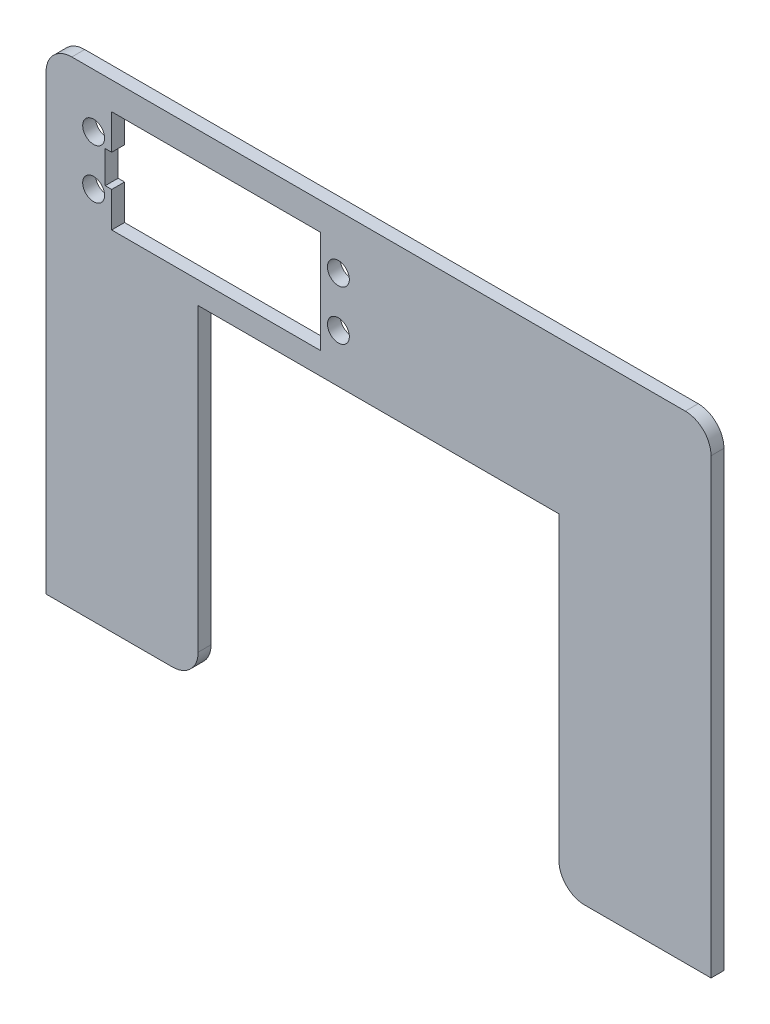
ISO-10303-21;
HEADER;
FILE_DESCRIPTION(('STEP AP214'),'2;1');
FILE_NAME('part.step','',(''),(''),'','','');
FILE_SCHEMA(('AUTOMOTIVE_DESIGN { 1 0 10303 214 1 1 1 1 }'));
ENDSEC;
DATA;
#1=APPLICATION_CONTEXT('core data for automotive mechanical design processes');
#2=APPLICATION_PROTOCOL_DEFINITION('international standard','automotive_design',2000,#1);
#3=PRODUCT_CONTEXT('',#1,'mechanical');
#4=PRODUCT('Part','Part','',(#3));
#5=PRODUCT_RELATED_PRODUCT_CATEGORY('part','',(#4));
#6=PRODUCT_DEFINITION_FORMATION('','',#4);
#7=PRODUCT_DEFINITION_CONTEXT('part definition',#1,'design');
#8=PRODUCT_DEFINITION('design','',#6,#7);
#9=PRODUCT_DEFINITION_SHAPE('','',#8);
#10=(LENGTH_UNIT() NAMED_UNIT(*) SI_UNIT(.MILLI.,.METRE.));
#11=(NAMED_UNIT(*) PLANE_ANGLE_UNIT() SI_UNIT($,.RADIAN.));
#12=(NAMED_UNIT(*) SI_UNIT($,.STERADIAN.) SOLID_ANGLE_UNIT());
#13=UNCERTAINTY_MEASURE_WITH_UNIT(LENGTH_MEASURE(1.E-05),#10,'distance_accuracy_value','');
#14=(GEOMETRIC_REPRESENTATION_CONTEXT(3) GLOBAL_UNCERTAINTY_ASSIGNED_CONTEXT((#13)) GLOBAL_UNIT_ASSIGNED_CONTEXT((#10,
#11,#12)) REPRESENTATION_CONTEXT('',''));
#15=CARTESIAN_POINT('',(0.,0.,0.));
#16=DIRECTION('',(0.,0.,1.));
#17=DIRECTION('',(1.,0.,0.));
#18=AXIS2_PLACEMENT_3D('',#15,#16,#17);
#19=CARTESIAN_POINT('',(-52.625,41.7055,0.));
#20=DIRECTION('',(-1.,0.,0.));
#21=DIRECTION('',(0.,0.,1.));
#22=AXIS2_PLACEMENT_3D('',#19,#20,#21);
#23=PLANE('',#22);
#24=DIRECTION('',(0.,-1.,0.));
#25=VECTOR('',#24,1.);
#26=CARTESIAN_POINT('',(-52.625,41.7055,2.54));
#27=LINE('',#26,#25);
#28=CARTESIAN_POINT('',(-52.625,41.7055,2.54));
#29=VERTEX_POINT('',#28);
#30=CARTESIAN_POINT('',(-52.625,34.784,2.54));
#31=VERTEX_POINT('',#30);
#32=EDGE_CURVE('E238',#29,#31,#27,.T.);
#33=ORIENTED_EDGE('',*,*,#32,.T.);
#34=DIRECTION('',(0.,0.,-1.));
#35=VECTOR('',#34,1.);
#36=CARTESIAN_POINT('',(-52.625,34.784,0.));
#37=LINE('',#36,#35);
#38=CARTESIAN_POINT('',(-52.625,34.784,0.));
#39=VERTEX_POINT('',#38);
#40=EDGE_CURVE('E11',#31,#39,#37,.T.);
#41=ORIENTED_EDGE('',*,*,#40,.T.);
#42=DIRECTION('',(0.,-1.,0.));
#43=VECTOR('',#42,1.);
#44=CARTESIAN_POINT('',(-52.625,41.7055,0.));
#45=LINE('',#44,#43);
#46=CARTESIAN_POINT('',(-52.625,41.7055,0.));
#47=VERTEX_POINT('',#46);
#48=EDGE_CURVE('E225',#47,#39,#45,.T.);
#49=ORIENTED_EDGE('',*,*,#48,.F.);
#50=DIRECTION('',(0.,0.,1.));
#51=VECTOR('',#50,1.);
#52=CARTESIAN_POINT('',(-52.625,41.7055,0.));
#53=LINE('',#52,#51);
#54=EDGE_CURVE('E250',#47,#29,#53,.T.);
#55=ORIENTED_EDGE('',*,*,#54,.T.);
#56=EDGE_LOOP('',(#33,#41,#49,#55));
#57=FACE_BOUND('',#56,.T.);
#58=ADVANCED_FACE('F33',(#57),#23,.F.);
#59=CARTESIAN_POINT('',(-65.56,-47.131,2.54));
#60=DIRECTION('',(1.,0.,0.));
#61=DIRECTION('',(0.,0.,-1.));
#62=AXIS2_PLACEMENT_3D('',#59,#60,#61);
#63=PLANE('',#62);
#64=DIRECTION('',(0.,-1.,0.));
#65=VECTOR('',#64,1.);
#66=CARTESIAN_POINT('',(-65.56,-47.131,2.54));
#67=LINE('',#66,#65);
#68=CARTESIAN_POINT('',(-65.56,42.051,2.54));
#69=VERTEX_POINT('',#68);
#70=CARTESIAN_POINT('',(-65.56,-47.131,2.54));
#71=VERTEX_POINT('',#70);
#72=EDGE_CURVE('E259',#69,#71,#67,.T.);
#73=ORIENTED_EDGE('',*,*,#72,.F.);
#74=DIRECTION('',(0.,0.,-1.));
#75=VECTOR('',#74,1.);
#76=CARTESIAN_POINT('',(-65.56,42.051,2.54));
#77=LINE('',#76,#75);
#78=CARTESIAN_POINT('',(-65.56,42.051,0.));
#79=VERTEX_POINT('',#78);
#80=EDGE_CURVE('E331',#69,#79,#77,.T.);
#81=ORIENTED_EDGE('',*,*,#80,.T.);
#82=DIRECTION('',(0.,-1.,0.));
#83=VECTOR('',#82,1.);
#84=CARTESIAN_POINT('',(-65.56,-47.131,0.));
#85=LINE('',#84,#83);
#86=CARTESIAN_POINT('',(-65.56,-47.131,0.));
#87=VERTEX_POINT('',#86);
#88=EDGE_CURVE('E252',#79,#87,#85,.T.);
#89=ORIENTED_EDGE('',*,*,#88,.T.);
#90=DIRECTION('',(0.,0.,-1.));
#91=VECTOR('',#90,1.);
#92=CARTESIAN_POINT('',(-65.56,-47.131,2.54));
#93=LINE('',#92,#91);
#94=EDGE_CURVE('E306',#71,#87,#93,.T.);
#95=ORIENTED_EDGE('',*,*,#94,.F.);
#96=EDGE_LOOP('',(#73,#81,#89,#95));
#97=FACE_BOUND('',#96,.T.);
#98=ADVANCED_FACE('F378',(#97),#63,.F.);
#99=CARTESIAN_POINT('',(-35.56,-47.131,2.54));
#100=DIRECTION('',(0.,1.,0.));
#101=DIRECTION('',(-1.,0.,0.));
#102=AXIS2_PLACEMENT_3D('',#99,#100,#101);
#103=PLANE('',#102);
#104=DIRECTION('',(1.,0.,0.));
#105=VECTOR('',#104,1.);
#106=CARTESIAN_POINT('',(-35.56,-47.131,0.));
#107=LINE('',#106,#105);
#108=CARTESIAN_POINT('',(-40.64,-47.131,0.));
#109=VERTEX_POINT('',#108);
#110=EDGE_CURVE('E281',#87,#109,#107,.T.);
#111=ORIENTED_EDGE('',*,*,#110,.T.);
#112=DIRECTION('',(0.,0.,-1.));
#113=VECTOR('',#112,1.);
#114=CARTESIAN_POINT('',(-40.64,-47.131,2.54));
#115=LINE('',#114,#113);
#116=CARTESIAN_POINT('',(-40.64,-47.131,2.54));
#117=VERTEX_POINT('',#116);
#118=EDGE_CURVE('E342',#109,#117,#115,.F.);
#119=ORIENTED_EDGE('',*,*,#118,.T.);
#120=DIRECTION('',(1.,0.,0.));
#121=VECTOR('',#120,1.);
#122=CARTESIAN_POINT('',(-35.56,-47.131,2.54));
#123=LINE('',#122,#121);
#124=EDGE_CURVE('E261',#71,#117,#123,.T.);
#125=ORIENTED_EDGE('',*,*,#124,.F.);
#126=ORIENTED_EDGE('',*,*,#94,.T.);
#127=EDGE_LOOP('',(#111,#119,#125,#126));
#128=FACE_BOUND('',#127,.T.);
#129=ADVANCED_FACE('F383',(#128),#103,.F.);
#130=CARTESIAN_POINT('',(-35.56,17.131,2.54));
#131=DIRECTION('',(-1.,0.,0.));
#132=DIRECTION('',(0.,0.,1.));
#133=AXIS2_PLACEMENT_3D('',#130,#131,#132);
#134=PLANE('',#133);
#135=DIRECTION('',(0.,1.,0.));
#136=VECTOR('',#135,1.);
#137=CARTESIAN_POINT('',(-35.56,17.131,2.54));
#138=LINE('',#137,#136);
#139=CARTESIAN_POINT('',(-35.56,-42.051,2.54));
#140=VERTEX_POINT('',#139);
#141=CARTESIAN_POINT('',(-35.56,17.131,2.54));
#142=VERTEX_POINT('',#141);
#143=EDGE_CURVE('E265',#140,#142,#138,.T.);
#144=ORIENTED_EDGE('',*,*,#143,.F.);
#145=DIRECTION('',(0.,0.,-1.));
#146=VECTOR('',#145,1.);
#147=CARTESIAN_POINT('',(-35.56,-42.051,2.54));
#148=LINE('',#147,#146);
#149=CARTESIAN_POINT('',(-35.56,-42.051,0.));
#150=VERTEX_POINT('',#149);
#151=EDGE_CURVE('E339',#140,#150,#148,.T.);
#152=ORIENTED_EDGE('',*,*,#151,.T.);
#153=DIRECTION('',(0.,1.,0.));
#154=VECTOR('',#153,1.);
#155=CARTESIAN_POINT('',(-35.56,17.131,0.));
#156=LINE('',#155,#154);
#157=CARTESIAN_POINT('',(-35.56,17.131,0.));
#158=VERTEX_POINT('',#157);
#159=EDGE_CURVE('E284',#150,#158,#156,.T.);
#160=ORIENTED_EDGE('',*,*,#159,.T.);
#161=DIRECTION('',(0.,0.,-1.));
#162=VECTOR('',#161,1.);
#163=CARTESIAN_POINT('',(-35.56,17.131,2.54));
#164=LINE('',#163,#162);
#165=EDGE_CURVE('E303',#142,#158,#164,.T.);
#166=ORIENTED_EDGE('',*,*,#165,.F.);
#167=EDGE_LOOP('',(#144,#152,#160,#166));
#168=FACE_BOUND('',#167,.T.);
#169=ADVANCED_FACE('F420',(#168),#134,.F.);
#170=CARTESIAN_POINT('',(35.56,17.131,2.54));
#171=DIRECTION('',(0.,1.,0.));
#172=DIRECTION('',(0.,0.,1.));
#173=AXIS2_PLACEMENT_3D('',#170,#171,#172);
#174=PLANE('',#173);
#175=DIRECTION('',(1.,0.,0.));
#176=VECTOR('',#175,1.);
#177=CARTESIAN_POINT('',(35.56,17.131,0.));
#178=LINE('',#177,#176);
#179=CARTESIAN_POINT('',(35.56,17.131,0.));
#180=VERTEX_POINT('',#179);
#181=EDGE_CURVE('E286',#158,#180,#178,.T.);
#182=ORIENTED_EDGE('',*,*,#181,.T.);
#183=DIRECTION('',(0.,0.,-1.));
#184=VECTOR('',#183,1.);
#185=CARTESIAN_POINT('',(35.56,17.131,2.54));
#186=LINE('',#185,#184);
#187=CARTESIAN_POINT('',(35.56,17.131,2.54));
#188=VERTEX_POINT('',#187);
#189=EDGE_CURVE('E300',#188,#180,#186,.T.);
#190=ORIENTED_EDGE('',*,*,#189,.F.);
#191=DIRECTION('',(1.,0.,0.));
#192=VECTOR('',#191,1.);
#193=CARTESIAN_POINT('',(35.56,17.131,2.54));
#194=LINE('',#193,#192);
#195=EDGE_CURVE('E267',#142,#188,#194,.T.);
#196=ORIENTED_EDGE('',*,*,#195,.F.);
#197=ORIENTED_EDGE('',*,*,#165,.T.);
#198=EDGE_LOOP('',(#182,#190,#196,#197));
#199=FACE_BOUND('',#198,.T.);
#200=ADVANCED_FACE('F416',(#199),#174,.F.);
#201=CARTESIAN_POINT('',(35.56,-47.131,2.54));
#202=DIRECTION('',(1.,0.,0.));
#203=DIRECTION('',(0.,1.,0.));
#204=AXIS2_PLACEMENT_3D('',#201,#202,#203);
#205=PLANE('',#204);
#206=DIRECTION('',(0.,-1.,0.));
#207=VECTOR('',#206,1.);
#208=CARTESIAN_POINT('',(35.56,-47.131,0.));
#209=LINE('',#208,#207);
#210=CARTESIAN_POINT('',(35.56,-42.051,0.));
#211=VERTEX_POINT('',#210);
#212=EDGE_CURVE('E288',#180,#211,#209,.T.);
#213=ORIENTED_EDGE('',*,*,#212,.T.);
#214=DIRECTION('',(0.,0.,-1.));
#215=VECTOR('',#214,1.);
#216=CARTESIAN_POINT('',(35.56,-42.051,2.54));
#217=LINE('',#216,#215);
#218=CARTESIAN_POINT('',(35.56,-42.051,2.54));
#219=VERTEX_POINT('',#218);
#220=EDGE_CURVE('E337',#211,#219,#217,.F.);
#221=ORIENTED_EDGE('',*,*,#220,.T.);
#222=DIRECTION('',(0.,-1.,0.));
#223=VECTOR('',#222,1.);
#224=CARTESIAN_POINT('',(35.56,-47.131,2.54));
#225=LINE('',#224,#223);
#226=EDGE_CURVE('E269',#188,#219,#225,.T.);
#227=ORIENTED_EDGE('',*,*,#226,.F.);
#228=ORIENTED_EDGE('',*,*,#189,.T.);
#229=EDGE_LOOP('',(#213,#221,#227,#228));
#230=FACE_BOUND('',#229,.T.);
#231=ADVANCED_FACE('F412',(#230),#205,.F.);
#232=CARTESIAN_POINT('',(65.56,-47.131,2.54));
#233=DIRECTION('',(0.,1.,0.));
#234=DIRECTION('',(-1.,0.,0.));
#235=AXIS2_PLACEMENT_3D('',#232,#233,#234);
#236=PLANE('',#235);
#237=DIRECTION('',(1.,0.,0.));
#238=VECTOR('',#237,1.);
#239=CARTESIAN_POINT('',(65.56,-47.131,2.54));
#240=LINE('',#239,#238);
#241=CARTESIAN_POINT('',(40.64,-47.131,2.54));
#242=VERTEX_POINT('',#241);
#243=CARTESIAN_POINT('',(65.56,-47.131,2.54));
#244=VERTEX_POINT('',#243);
#245=EDGE_CURVE('E271',#242,#244,#240,.T.);
#246=ORIENTED_EDGE('',*,*,#245,.F.);
#247=DIRECTION('',(0.,0.,-1.));
#248=VECTOR('',#247,1.);
#249=CARTESIAN_POINT('',(40.64,-47.131,2.54));
#250=LINE('',#249,#248);
#251=CARTESIAN_POINT('',(40.64,-47.131,0.));
#252=VERTEX_POINT('',#251);
#253=EDGE_CURVE('E334',#242,#252,#250,.T.);
#254=ORIENTED_EDGE('',*,*,#253,.T.);
#255=DIRECTION('',(1.,0.,0.));
#256=VECTOR('',#255,1.);
#257=CARTESIAN_POINT('',(65.56,-47.131,0.));
#258=LINE('',#257,#256);
#259=CARTESIAN_POINT('',(65.56,-47.131,0.));
#260=VERTEX_POINT('',#259);
#261=EDGE_CURVE('E291',#252,#260,#258,.T.);
#262=ORIENTED_EDGE('',*,*,#261,.T.);
#263=DIRECTION('',(0.,0.,-1.));
#264=VECTOR('',#263,1.);
#265=CARTESIAN_POINT('',(65.56,-47.131,2.54));
#266=LINE('',#265,#264);
#267=EDGE_CURVE('E279',#244,#260,#266,.T.);
#268=ORIENTED_EDGE('',*,*,#267,.F.);
#269=EDGE_LOOP('',(#246,#254,#262,#268));
#270=FACE_BOUND('',#269,.T.);
#271=ADVANCED_FACE('F408',(#270),#236,.F.);
#272=CARTESIAN_POINT('',(65.56,-47.131,2.54));
#273=DIRECTION('',(-1.,0.,0.));
#274=DIRECTION('',(0.,0.,1.));
#275=AXIS2_PLACEMENT_3D('',#272,#273,#274);
#276=PLANE('',#275);
#277=DIRECTION('',(0.,1.,0.));
#278=VECTOR('',#277,1.);
#279=CARTESIAN_POINT('',(65.56,-47.131,0.));
#280=LINE('',#279,#278);
#281=CARTESIAN_POINT('',(65.56,42.051,0.));
#282=VERTEX_POINT('',#281);
#283=EDGE_CURVE('E293',#260,#282,#280,.T.);
#284=ORIENTED_EDGE('',*,*,#283,.T.);
#285=DIRECTION('',(0.,0.,-1.));
#286=VECTOR('',#285,1.);
#287=CARTESIAN_POINT('',(65.56,42.051,2.54));
#288=LINE('',#287,#286);
#289=CARTESIAN_POINT('',(65.56,42.051,2.54));
#290=VERTEX_POINT('',#289);
#291=EDGE_CURVE('E322',#282,#290,#288,.F.);
#292=ORIENTED_EDGE('',*,*,#291,.T.);
#293=DIRECTION('',(0.,1.,0.));
#294=VECTOR('',#293,1.);
#295=CARTESIAN_POINT('',(65.56,-47.131,2.54));
#296=LINE('',#295,#294);
#297=EDGE_CURVE('E273',#244,#290,#296,.T.);
#298=ORIENTED_EDGE('',*,*,#297,.F.);
#299=ORIENTED_EDGE('',*,*,#267,.T.);
#300=EDGE_LOOP('',(#284,#292,#298,#299));
#301=FACE_BOUND('',#300,.T.);
#302=ADVANCED_FACE('F404',(#301),#276,.F.);
#303=CARTESIAN_POINT('',(65.56,47.131,2.54));
#304=DIRECTION('',(0.,-1.,0.));
#305=DIRECTION('',(0.,0.,-1.));
#306=AXIS2_PLACEMENT_3D('',#303,#304,#305);
#307=PLANE('',#306);
#308=DIRECTION('',(-1.,0.,0.));
#309=VECTOR('',#308,1.);
#310=CARTESIAN_POINT('',(65.56,47.131,2.54));
#311=LINE('',#310,#309);
#312=CARTESIAN_POINT('',(60.48,47.131,2.54));
#313=VERTEX_POINT('',#312);
#314=CARTESIAN_POINT('',(-60.48,47.131,2.54));
#315=VERTEX_POINT('',#314);
#316=EDGE_CURVE('E276',#313,#315,#311,.T.);
#317=ORIENTED_EDGE('',*,*,#316,.F.);
#318=DIRECTION('',(0.,0.,-1.));
#319=VECTOR('',#318,1.);
#320=CARTESIAN_POINT('',(60.48,47.131,2.54));
#321=LINE('',#320,#319);
#322=CARTESIAN_POINT('',(60.48,47.131,0.));
#323=VERTEX_POINT('',#322);
#324=EDGE_CURVE('E311',#313,#323,#321,.T.);
#325=ORIENTED_EDGE('',*,*,#324,.T.);
#326=DIRECTION('',(-1.,0.,0.));
#327=VECTOR('',#326,1.);
#328=CARTESIAN_POINT('',(65.56,47.131,0.));
#329=LINE('',#328,#327);
#330=CARTESIAN_POINT('',(-60.48,47.131,0.));
#331=VERTEX_POINT('',#330);
#332=EDGE_CURVE('E262',#323,#331,#329,.T.);
#333=ORIENTED_EDGE('',*,*,#332,.T.);
#334=DIRECTION('',(0.,0.,-1.));
#335=VECTOR('',#334,1.);
#336=CARTESIAN_POINT('',(-60.48,47.131,2.54));
#337=LINE('',#336,#335);
#338=EDGE_CURVE('E309',#331,#315,#337,.F.);
#339=ORIENTED_EDGE('',*,*,#338,.T.);
#340=EDGE_LOOP('',(#317,#325,#333,#339));
#341=FACE_BOUND('',#340,.T.);
#342=ADVANCED_FACE('F399',(#341),#307,.F.);
#343=CARTESIAN_POINT('',(0.,0.,2.54));
#344=DIRECTION('',(0.,0.,1.));
#345=DIRECTION('',(1.,0.,0.));
#346=AXIS2_PLACEMENT_3D('',#343,#344,#345);
#347=PLANE('',#346);
#348=DIRECTION('',(-1.,0.,0.));
#349=VECTOR('',#348,1.);
#350=CARTESIAN_POINT('',(-51.355,34.784,2.54));
#351=LINE('',#350,#349);
#352=CARTESIAN_POINT('',(-53.895,34.784,2.54));
#353=VERTEX_POINT('',#352);
#354=EDGE_CURVE('E192',#31,#353,#351,.T.);
#355=ORIENTED_EDGE('',*,*,#354,.F.);
#356=ORIENTED_EDGE('',*,*,#32,.F.);
#357=DIRECTION('',(-1.,0.,0.));
#358=VECTOR('',#357,1.);
#359=CARTESIAN_POINT('',(-11.477,41.7055,2.54));
#360=LINE('',#359,#358);
#361=CARTESIAN_POINT('',(-11.477,41.7055,2.54));
#362=VERTEX_POINT('',#361);
#363=EDGE_CURVE('E247',#362,#29,#360,.T.);
#364=ORIENTED_EDGE('',*,*,#363,.F.);
#365=DIRECTION('',(0.,1.,0.));
#366=VECTOR('',#365,1.);
#367=CARTESIAN_POINT('',(-11.477,41.7055,2.54));
#368=LINE('',#367,#366);
#369=CARTESIAN_POINT('',(-11.477,21.5125,2.54));
#370=VERTEX_POINT('',#369);
#371=EDGE_CURVE('E244',#370,#362,#368,.T.);
#372=ORIENTED_EDGE('',*,*,#371,.F.);
#373=DIRECTION('',(1.,0.,0.));
#374=VECTOR('',#373,1.);
#375=CARTESIAN_POINT('',(-11.477,21.5125,2.54));
#376=LINE('',#375,#374);
#377=CARTESIAN_POINT('',(-52.625,21.5125,2.54));
#378=VERTEX_POINT('',#377);
#379=EDGE_CURVE('E241',#378,#370,#376,.T.);
#380=ORIENTED_EDGE('',*,*,#379,.F.);
#381=CARTESIAN_POINT('',(-52.625,28.434,2.54));
#382=VERTEX_POINT('',#381);
#383=EDGE_CURVE('E204',#382,#378,#27,.T.);
#384=ORIENTED_EDGE('',*,*,#383,.F.);
#385=DIRECTION('',(1.,0.,0.));
#386=VECTOR('',#385,1.);
#387=CARTESIAN_POINT('',(-51.355,28.434,2.54));
#388=LINE('',#387,#386);
#389=CARTESIAN_POINT('',(-53.895,28.434,2.54));
#390=VERTEX_POINT('',#389);
#391=EDGE_CURVE('E48',#390,#382,#388,.T.);
#392=ORIENTED_EDGE('',*,*,#391,.F.);
#393=DIRECTION('',(0.,-1.,0.));
#394=VECTOR('',#393,1.);
#395=CARTESIAN_POINT('',(-53.895,28.434,2.54));
#396=LINE('',#395,#394);
#397=EDGE_CURVE('E179',#353,#390,#396,.T.);
#398=ORIENTED_EDGE('',*,*,#397,.F.);
#399=EDGE_LOOP('',(#355,#356,#364,#372,#380,#384,#392,#398));
#400=FACE_BOUND('',#399,.T.);
#401=CARTESIAN_POINT('',(-7.921,26.7195,2.54));
#402=DIRECTION('',(0.,0.,1.));
#403=DIRECTION('',(1.,0.,0.));
#404=AXIS2_PLACEMENT_3D('',#401,#402,#403);
#405=CIRCLE('',#404,2.159);
#406=CARTESIAN_POINT('',(-5.762,26.7195,2.54));
#407=VERTEX_POINT('',#406);
#408=EDGE_CURVE('E199',#407,#407,#405,.T.);
#409=ORIENTED_EDGE('',*,*,#408,.F.);
#410=EDGE_LOOP('',(#409));
#411=FACE_BOUND('',#410,.T.);
#412=CARTESIAN_POINT('',(-7.921,36.4985,2.54));
#413=DIRECTION('',(0.,0.,1.));
#414=DIRECTION('',(1.,0.,0.));
#415=AXIS2_PLACEMENT_3D('',#412,#413,#414);
#416=CIRCLE('',#415,2.159);
#417=CARTESIAN_POINT('',(-5.762,36.4985,2.54));
#418=VERTEX_POINT('',#417);
#419=EDGE_CURVE('E217',#418,#418,#416,.T.);
#420=ORIENTED_EDGE('',*,*,#419,.F.);
#421=EDGE_LOOP('',(#420));
#422=FACE_BOUND('',#421,.T.);
#423=CARTESIAN_POINT('',(-56.181,26.7195,2.54));
#424=DIRECTION('',(0.,0.,1.));
#425=DIRECTION('',(1.,0.,0.));
#426=AXIS2_PLACEMENT_3D('',#423,#424,#425);
#427=CIRCLE('',#426,2.159);
#428=CARTESIAN_POINT('',(-54.022,26.7195,2.54));
#429=VERTEX_POINT('',#428);
#430=EDGE_CURVE('E211',#429,#429,#427,.T.);
#431=ORIENTED_EDGE('',*,*,#430,.F.);
#432=EDGE_LOOP('',(#431));
#433=FACE_BOUND('',#432,.T.);
#434=CARTESIAN_POINT('',(-56.181,36.4985,2.54));
#435=DIRECTION('',(0.,0.,1.));
#436=DIRECTION('',(1.,0.,0.));
#437=AXIS2_PLACEMENT_3D('',#434,#435,#436);
#438=CIRCLE('',#437,2.159);
#439=CARTESIAN_POINT('',(-54.022,36.4985,2.54));
#440=VERTEX_POINT('',#439);
#441=EDGE_CURVE('E205',#440,#440,#438,.T.);
#442=ORIENTED_EDGE('',*,*,#441,.F.);
#443=EDGE_LOOP('',(#442));
#444=FACE_BOUND('',#443,.T.);
#445=ORIENTED_EDGE('',*,*,#297,.T.);
#446=CARTESIAN_POINT('',(60.48,42.051,2.54));
#447=DIRECTION('',(0.,0.,1.));
#448=DIRECTION('',(1.,0.,0.));
#449=AXIS2_PLACEMENT_3D('',#446,#447,#448);
#450=CIRCLE('',#449,5.08);
#451=EDGE_CURVE('E329',#290,#313,#450,.T.);
#452=ORIENTED_EDGE('',*,*,#451,.T.);
#453=ORIENTED_EDGE('',*,*,#316,.T.);
#454=CARTESIAN_POINT('',(-60.48,42.051,2.54));
#455=DIRECTION('',(0.,0.,1.));
#456=DIRECTION('',(1.,0.,0.));
#457=AXIS2_PLACEMENT_3D('',#454,#455,#456);
#458=CIRCLE('',#457,5.08);
#459=EDGE_CURVE('E327',#315,#69,#458,.T.);
#460=ORIENTED_EDGE('',*,*,#459,.T.);
#461=ORIENTED_EDGE('',*,*,#72,.T.);
#462=ORIENTED_EDGE('',*,*,#124,.T.);
#463=CARTESIAN_POINT('',(-40.64,-42.051,2.54));
#464=DIRECTION('',(0.,0.,1.));
#465=DIRECTION('',(1.,0.,0.));
#466=AXIS2_PLACEMENT_3D('',#463,#464,#465);
#467=CIRCLE('',#466,5.08);
#468=EDGE_CURVE('E324',#117,#140,#467,.T.);
#469=ORIENTED_EDGE('',*,*,#468,.T.);
#470=ORIENTED_EDGE('',*,*,#143,.T.);
#471=ORIENTED_EDGE('',*,*,#195,.T.);
#472=ORIENTED_EDGE('',*,*,#226,.T.);
#473=CARTESIAN_POINT('',(40.64,-42.051,2.54));
#474=DIRECTION('',(0.,0.,1.));
#475=DIRECTION('',(1.,0.,0.));
#476=AXIS2_PLACEMENT_3D('',#473,#474,#475);
#477=CIRCLE('',#476,5.08);
#478=EDGE_CURVE('E56',#219,#242,#477,.T.);
#479=ORIENTED_EDGE('',*,*,#478,.T.);
#480=ORIENTED_EDGE('',*,*,#245,.T.);
#481=EDGE_LOOP('',(#445,#452,#453,#460,#461,#462,#469,#470,#471,#472,#479,#480));
#482=FACE_BOUND('',#481,.T.);
#483=ADVANCED_FACE('F350',(#400,#411,#422,#433,#444,#482),#347,.T.);
#484=CARTESIAN_POINT('',(0.,0.,0.));
#485=DIRECTION('',(0.,0.,1.));
#486=DIRECTION('',(1.,0.,0.));
#487=AXIS2_PLACEMENT_3D('',#484,#485,#486);
#488=PLANE('',#487);
#489=CARTESIAN_POINT('',(-7.921,26.7195,0.));
#490=DIRECTION('',(0.,0.,1.));
#491=DIRECTION('',(1.,0.,0.));
#492=AXIS2_PLACEMENT_3D('',#489,#490,#491);
#493=CIRCLE('',#492,2.159);
#494=CARTESIAN_POINT('',(-5.762,26.7195,0.));
#495=VERTEX_POINT('',#494);
#496=EDGE_CURVE('E220',#495,#495,#493,.T.);
#497=ORIENTED_EDGE('',*,*,#496,.T.);
#498=EDGE_LOOP('',(#497));
#499=FACE_BOUND('',#498,.T.);
#500=CARTESIAN_POINT('',(-7.921,36.4985,0.));
#501=DIRECTION('',(0.,0.,1.));
#502=DIRECTION('',(1.,0.,0.));
#503=AXIS2_PLACEMENT_3D('',#500,#501,#502);
#504=CIRCLE('',#503,2.159);
#505=CARTESIAN_POINT('',(-5.762,36.4985,0.));
#506=VERTEX_POINT('',#505);
#507=EDGE_CURVE('E214',#506,#506,#504,.T.);
#508=ORIENTED_EDGE('',*,*,#507,.T.);
#509=EDGE_LOOP('',(#508));
#510=FACE_BOUND('',#509,.T.);
#511=CARTESIAN_POINT('',(-56.181,26.7195,0.));
#512=DIRECTION('',(0.,0.,1.));
#513=DIRECTION('',(1.,0.,0.));
#514=AXIS2_PLACEMENT_3D('',#511,#512,#513);
#515=CIRCLE('',#514,2.159);
#516=CARTESIAN_POINT('',(-54.022,26.7195,0.));
#517=VERTEX_POINT('',#516);
#518=EDGE_CURVE('E208',#517,#517,#515,.T.);
#519=ORIENTED_EDGE('',*,*,#518,.T.);
#520=EDGE_LOOP('',(#519));
#521=FACE_BOUND('',#520,.T.);
#522=CARTESIAN_POINT('',(-56.181,36.4985,0.));
#523=DIRECTION('',(0.,0.,1.));
#524=DIRECTION('',(1.,0.,0.));
#525=AXIS2_PLACEMENT_3D('',#522,#523,#524);
#526=CIRCLE('',#525,2.159);
#527=CARTESIAN_POINT('',(-54.022,36.4985,0.));
#528=VERTEX_POINT('',#527);
#529=EDGE_CURVE('E201',#528,#528,#526,.T.);
#530=ORIENTED_EDGE('',*,*,#529,.T.);
#531=EDGE_LOOP('',(#530));
#532=FACE_BOUND('',#531,.T.);
#533=ORIENTED_EDGE('',*,*,#48,.T.);
#534=DIRECTION('',(-1.,0.,0.));
#535=VECTOR('',#534,1.);
#536=CARTESIAN_POINT('',(-51.355,34.784,0.));
#537=LINE('',#536,#535);
#538=CARTESIAN_POINT('',(-53.895,34.784,0.));
#539=VERTEX_POINT('',#538);
#540=EDGE_CURVE('E181',#39,#539,#537,.T.);
#541=ORIENTED_EDGE('',*,*,#540,.T.);
#542=DIRECTION('',(0.,-1.,0.));
#543=VECTOR('',#542,1.);
#544=CARTESIAN_POINT('',(-53.895,28.434,0.));
#545=LINE('',#544,#543);
#546=CARTESIAN_POINT('',(-53.895,28.434,0.));
#547=VERTEX_POINT('',#546);
#548=EDGE_CURVE('E176',#539,#547,#545,.T.);
#549=ORIENTED_EDGE('',*,*,#548,.T.);
#550=DIRECTION('',(1.,0.,0.));
#551=VECTOR('',#550,1.);
#552=CARTESIAN_POINT('',(-51.355,28.434,0.));
#553=LINE('',#552,#551);
#554=CARTESIAN_POINT('',(-52.625,28.434,0.));
#555=VERTEX_POINT('',#554);
#556=EDGE_CURVE('E184',#547,#555,#553,.T.);
#557=ORIENTED_EDGE('',*,*,#556,.T.);
#558=CARTESIAN_POINT('',(-52.625,21.5125,0.));
#559=VERTEX_POINT('',#558);
#560=EDGE_CURVE('E228',#555,#559,#45,.T.);
#561=ORIENTED_EDGE('',*,*,#560,.T.);
#562=DIRECTION('',(1.,0.,0.));
#563=VECTOR('',#562,1.);
#564=CARTESIAN_POINT('',(-11.477,21.5125,0.));
#565=LINE('',#564,#563);
#566=CARTESIAN_POINT('',(-11.477,21.5125,0.));
#567=VERTEX_POINT('',#566);
#568=EDGE_CURVE('E227',#559,#567,#565,.T.);
#569=ORIENTED_EDGE('',*,*,#568,.T.);
#570=DIRECTION('',(0.,1.,0.));
#571=VECTOR('',#570,1.);
#572=CARTESIAN_POINT('',(-11.477,31.609,0.));
#573=LINE('',#572,#571);
#574=CARTESIAN_POINT('',(-11.477,41.7055,0.));
#575=VERTEX_POINT('',#574);
#576=EDGE_CURVE('E231',#567,#575,#573,.T.);
#577=ORIENTED_EDGE('',*,*,#576,.T.);
#578=DIRECTION('',(-1.,0.,0.));
#579=VECTOR('',#578,1.);
#580=CARTESIAN_POINT('',(-11.477,41.7055,0.));
#581=LINE('',#580,#579);
#582=EDGE_CURVE('E234',#575,#47,#581,.T.);
#583=ORIENTED_EDGE('',*,*,#582,.T.);
#584=EDGE_LOOP('',(#533,#541,#549,#557,#561,#569,#577,#583));
#585=FACE_BOUND('',#584,.T.);
#586=ORIENTED_EDGE('',*,*,#332,.F.);
#587=CARTESIAN_POINT('',(60.48,42.051,0.));
#588=DIRECTION('',(0.,0.,1.));
#589=DIRECTION('',(1.,0.,0.));
#590=AXIS2_PLACEMENT_3D('',#587,#588,#589);
#591=CIRCLE('',#590,5.08);
#592=EDGE_CURVE('E320',#323,#282,#591,.F.);
#593=ORIENTED_EDGE('',*,*,#592,.T.);
#594=ORIENTED_EDGE('',*,*,#283,.F.);
#595=ORIENTED_EDGE('',*,*,#261,.F.);
#596=CARTESIAN_POINT('',(40.64,-42.051,0.));
#597=DIRECTION('',(0.,0.,1.));
#598=DIRECTION('',(1.,0.,0.));
#599=AXIS2_PLACEMENT_3D('',#596,#597,#598);
#600=CIRCLE('',#599,5.08);
#601=EDGE_CURVE('E316',#252,#211,#600,.F.);
#602=ORIENTED_EDGE('',*,*,#601,.T.);
#603=ORIENTED_EDGE('',*,*,#212,.F.);
#604=ORIENTED_EDGE('',*,*,#181,.F.);
#605=ORIENTED_EDGE('',*,*,#159,.F.);
#606=CARTESIAN_POINT('',(-40.64,-42.051,0.));
#607=DIRECTION('',(0.,0.,1.));
#608=DIRECTION('',(1.,0.,0.));
#609=AXIS2_PLACEMENT_3D('',#606,#607,#608);
#610=CIRCLE('',#609,5.08);
#611=EDGE_CURVE('E314',#150,#109,#610,.F.);
#612=ORIENTED_EDGE('',*,*,#611,.T.);
#613=ORIENTED_EDGE('',*,*,#110,.F.);
#614=ORIENTED_EDGE('',*,*,#88,.F.);
#615=CARTESIAN_POINT('',(-60.48,42.051,0.));
#616=DIRECTION('',(0.,0.,1.));
#617=DIRECTION('',(1.,0.,0.));
#618=AXIS2_PLACEMENT_3D('',#615,#616,#617);
#619=CIRCLE('',#618,5.08);
#620=EDGE_CURVE('E318',#79,#331,#619,.F.);
#621=ORIENTED_EDGE('',*,*,#620,.T.);
#622=EDGE_LOOP('',(#586,#593,#594,#595,#602,#603,#604,#605,#612,#613,#614,#621));
#623=FACE_BOUND('',#622,.T.);
#624=ADVANCED_FACE('F190',(#499,#510,#521,#532,#585,#623),#488,.F.);
#625=ORIENTED_EDGE('',*,*,#560,.F.);
#626=DIRECTION('',(0.,0.,1.));
#627=VECTOR('',#626,1.);
#628=CARTESIAN_POINT('',(-52.625,28.434,0.));
#629=LINE('',#628,#627);
#630=EDGE_CURVE('E41',#555,#382,#629,.T.);
#631=ORIENTED_EDGE('',*,*,#630,.T.);
#632=ORIENTED_EDGE('',*,*,#383,.T.);
#633=DIRECTION('',(0.,0.,1.));
#634=VECTOR('',#633,1.);
#635=CARTESIAN_POINT('',(-52.625,21.5125,0.));
#636=LINE('',#635,#634);
#637=EDGE_CURVE('E237',#559,#378,#636,.T.);
#638=ORIENTED_EDGE('',*,*,#637,.F.);
#639=EDGE_LOOP('',(#625,#631,#632,#638));
#640=FACE_BOUND('',#639,.T.);
#641=ADVANCED_FACE('F345',(#640),#23,.F.);
#642=CARTESIAN_POINT('',(-11.477,41.7055,0.));
#643=DIRECTION('',(0.,1.,0.));
#644=DIRECTION('',(0.,0.,1.));
#645=AXIS2_PLACEMENT_3D('',#642,#643,#644);
#646=PLANE('',#645);
#647=ORIENTED_EDGE('',*,*,#363,.T.);
#648=ORIENTED_EDGE('',*,*,#54,.F.);
#649=ORIENTED_EDGE('',*,*,#582,.F.);
#650=DIRECTION('',(0.,0.,1.));
#651=VECTOR('',#650,1.);
#652=CARTESIAN_POINT('',(-11.477,41.7055,0.));
#653=LINE('',#652,#651);
#654=EDGE_CURVE('E253',#575,#362,#653,.T.);
#655=ORIENTED_EDGE('',*,*,#654,.T.);
#656=EDGE_LOOP('',(#647,#648,#649,#655));
#657=FACE_BOUND('',#656,.T.);
#658=ADVANCED_FACE('F362',(#657),#646,.F.);
#659=CARTESIAN_POINT('',(-11.477,41.7055,0.));
#660=DIRECTION('',(1.,0.,0.));
#661=DIRECTION('',(0.,0.,-1.));
#662=AXIS2_PLACEMENT_3D('',#659,#660,#661);
#663=PLANE('',#662);
#664=ORIENTED_EDGE('',*,*,#371,.T.);
#665=ORIENTED_EDGE('',*,*,#654,.F.);
#666=ORIENTED_EDGE('',*,*,#576,.F.);
#667=DIRECTION('',(0.,0.,1.));
#668=VECTOR('',#667,1.);
#669=CARTESIAN_POINT('',(-11.477,21.5125,0.));
#670=LINE('',#669,#668);
#671=EDGE_CURVE('E255',#567,#370,#670,.T.);
#672=ORIENTED_EDGE('',*,*,#671,.T.);
#673=EDGE_LOOP('',(#664,#665,#666,#672));
#674=FACE_BOUND('',#673,.T.);
#675=ADVANCED_FACE('F360',(#674),#663,.F.);
#676=CARTESIAN_POINT('',(-11.477,21.5125,0.));
#677=DIRECTION('',(0.,-1.,0.));
#678=DIRECTION('',(0.,0.,-1.));
#679=AXIS2_PLACEMENT_3D('',#676,#677,#678);
#680=PLANE('',#679);
#681=ORIENTED_EDGE('',*,*,#379,.T.);
#682=ORIENTED_EDGE('',*,*,#671,.F.);
#683=ORIENTED_EDGE('',*,*,#568,.F.);
#684=ORIENTED_EDGE('',*,*,#637,.T.);
#685=EDGE_LOOP('',(#681,#682,#683,#684));
#686=FACE_BOUND('',#685,.T.);
#687=ADVANCED_FACE('F356',(#686),#680,.F.);
#688=CARTESIAN_POINT('',(-56.181,36.4985,0.));
#689=DIRECTION('',(0.,0.,1.));
#690=DIRECTION('',(1.,0.,0.));
#691=AXIS2_PLACEMENT_3D('',#688,#689,#690);
#692=CYLINDRICAL_SURFACE('',#691,2.159);
#693=ORIENTED_EDGE('',*,*,#529,.F.);
#694=EDGE_LOOP('',(#693));
#695=FACE_BOUND('',#694,.T.);
#696=ORIENTED_EDGE('',*,*,#441,.T.);
#697=EDGE_LOOP('',(#696));
#698=FACE_BOUND('',#697,.T.);
#699=ADVANCED_FACE('F519',(#695,#698),#692,.F.);
#700=CARTESIAN_POINT('',(-56.181,26.7195,0.));
#701=DIRECTION('',(0.,0.,1.));
#702=DIRECTION('',(1.,0.,0.));
#703=AXIS2_PLACEMENT_3D('',#700,#701,#702);
#704=CYLINDRICAL_SURFACE('',#703,2.159);
#705=ORIENTED_EDGE('',*,*,#518,.F.);
#706=EDGE_LOOP('',(#705));
#707=FACE_BOUND('',#706,.T.);
#708=ORIENTED_EDGE('',*,*,#430,.T.);
#709=EDGE_LOOP('',(#708));
#710=FACE_BOUND('',#709,.T.);
#711=ADVANCED_FACE('F522',(#707,#710),#704,.F.);
#712=CARTESIAN_POINT('',(-7.921,36.4985,0.));
#713=DIRECTION('',(0.,0.,1.));
#714=DIRECTION('',(1.,0.,0.));
#715=AXIS2_PLACEMENT_3D('',#712,#713,#714);
#716=CYLINDRICAL_SURFACE('',#715,2.159);
#717=ORIENTED_EDGE('',*,*,#507,.F.);
#718=EDGE_LOOP('',(#717));
#719=FACE_BOUND('',#718,.T.);
#720=ORIENTED_EDGE('',*,*,#419,.T.);
#721=EDGE_LOOP('',(#720));
#722=FACE_BOUND('',#721,.T.);
#723=ADVANCED_FACE('F526',(#719,#722),#716,.F.);
#724=CARTESIAN_POINT('',(-7.921,26.7195,0.));
#725=DIRECTION('',(0.,0.,1.));
#726=DIRECTION('',(1.,0.,0.));
#727=AXIS2_PLACEMENT_3D('',#724,#725,#726);
#728=CYLINDRICAL_SURFACE('',#727,2.159);
#729=ORIENTED_EDGE('',*,*,#496,.F.);
#730=EDGE_LOOP('',(#729));
#731=FACE_BOUND('',#730,.T.);
#732=ORIENTED_EDGE('',*,*,#408,.T.);
#733=EDGE_LOOP('',(#732));
#734=FACE_BOUND('',#733,.T.);
#735=ADVANCED_FACE('F432',(#731,#734),#728,.F.);
#736=CARTESIAN_POINT('',(60.48,42.051,2.54));
#737=DIRECTION('',(0.,0.,-1.));
#738=DIRECTION('',(-1.,0.,0.));
#739=AXIS2_PLACEMENT_3D('',#736,#737,#738);
#740=CYLINDRICAL_SURFACE('',#739,5.08);
#741=ORIENTED_EDGE('',*,*,#451,.F.);
#742=ORIENTED_EDGE('',*,*,#291,.F.);
#743=ORIENTED_EDGE('',*,*,#592,.F.);
#744=ORIENTED_EDGE('',*,*,#324,.F.);
#745=EDGE_LOOP('',(#741,#742,#743,#744));
#746=FACE_BOUND('',#745,.T.);
#747=ADVANCED_FACE('F428',(#746),#740,.T.);
#748=CARTESIAN_POINT('',(-60.48,42.051,2.54));
#749=DIRECTION('',(0.,0.,-1.));
#750=DIRECTION('',(-1.,0.,0.));
#751=AXIS2_PLACEMENT_3D('',#748,#749,#750);
#752=CYLINDRICAL_SURFACE('',#751,5.08);
#753=ORIENTED_EDGE('',*,*,#459,.F.);
#754=ORIENTED_EDGE('',*,*,#338,.F.);
#755=ORIENTED_EDGE('',*,*,#620,.F.);
#756=ORIENTED_EDGE('',*,*,#80,.F.);
#757=EDGE_LOOP('',(#753,#754,#755,#756));
#758=FACE_BOUND('',#757,.T.);
#759=ADVANCED_FACE('F431',(#758),#752,.T.);
#760=CARTESIAN_POINT('',(40.64,-42.051,2.54));
#761=DIRECTION('',(0.,0.,-1.));
#762=DIRECTION('',(-1.,0.,0.));
#763=AXIS2_PLACEMENT_3D('',#760,#761,#762);
#764=CYLINDRICAL_SURFACE('',#763,5.08);
#765=ORIENTED_EDGE('',*,*,#478,.F.);
#766=ORIENTED_EDGE('',*,*,#220,.F.);
#767=ORIENTED_EDGE('',*,*,#601,.F.);
#768=ORIENTED_EDGE('',*,*,#253,.F.);
#769=EDGE_LOOP('',(#765,#766,#767,#768));
#770=FACE_BOUND('',#769,.T.);
#771=ADVANCED_FACE('F375',(#770),#764,.T.);
#772=CARTESIAN_POINT('',(-40.64,-42.051,2.54));
#773=DIRECTION('',(0.,0.,-1.));
#774=DIRECTION('',(-1.,0.,0.));
#775=AXIS2_PLACEMENT_3D('',#772,#773,#774);
#776=CYLINDRICAL_SURFACE('',#775,5.08);
#777=ORIENTED_EDGE('',*,*,#468,.F.);
#778=ORIENTED_EDGE('',*,*,#118,.F.);
#779=ORIENTED_EDGE('',*,*,#611,.F.);
#780=ORIENTED_EDGE('',*,*,#151,.F.);
#781=EDGE_LOOP('',(#777,#778,#779,#780));
#782=FACE_BOUND('',#781,.T.);
#783=ADVANCED_FACE('F35',(#782),#776,.T.);
#784=CARTESIAN_POINT('',(-51.355,34.784,0.));
#785=DIRECTION('',(0.,1.,0.));
#786=DIRECTION('',(0.,0.,1.));
#787=AXIS2_PLACEMENT_3D('',#784,#785,#786);
#788=PLANE('',#787);
#789=ORIENTED_EDGE('',*,*,#354,.T.);
#790=DIRECTION('',(0.,0.,1.));
#791=VECTOR('',#790,1.);
#792=CARTESIAN_POINT('',(-53.895,34.784,0.));
#793=LINE('',#792,#791);
#794=EDGE_CURVE('E180',#539,#353,#793,.T.);
#795=ORIENTED_EDGE('',*,*,#794,.F.);
#796=ORIENTED_EDGE('',*,*,#540,.F.);
#797=ORIENTED_EDGE('',*,*,#40,.F.);
#798=EDGE_LOOP('',(#789,#795,#796,#797));
#799=FACE_BOUND('',#798,.T.);
#800=ADVANCED_FACE('F367',(#799),#788,.F.);
#801=CARTESIAN_POINT('',(-51.355,28.434,0.));
#802=DIRECTION('',(0.,-1.,0.));
#803=DIRECTION('',(0.,0.,-1.));
#804=AXIS2_PLACEMENT_3D('',#801,#802,#803);
#805=PLANE('',#804);
#806=ORIENTED_EDGE('',*,*,#556,.F.);
#807=DIRECTION('',(0.,0.,1.));
#808=VECTOR('',#807,1.);
#809=CARTESIAN_POINT('',(-53.895,28.434,0.));
#810=LINE('',#809,#808);
#811=EDGE_CURVE('E171',#547,#390,#810,.T.);
#812=ORIENTED_EDGE('',*,*,#811,.T.);
#813=ORIENTED_EDGE('',*,*,#391,.T.);
#814=ORIENTED_EDGE('',*,*,#630,.F.);
#815=EDGE_LOOP('',(#806,#812,#813,#814));
#816=FACE_BOUND('',#815,.T.);
#817=ADVANCED_FACE('F185',(#816),#805,.F.);
#818=CARTESIAN_POINT('',(-53.895,28.434,0.));
#819=DIRECTION('',(-1.,0.,0.));
#820=DIRECTION('',(0.,0.,1.));
#821=AXIS2_PLACEMENT_3D('',#818,#819,#820);
#822=PLANE('',#821);
#823=ORIENTED_EDGE('',*,*,#397,.T.);
#824=ORIENTED_EDGE('',*,*,#811,.F.);
#825=ORIENTED_EDGE('',*,*,#548,.F.);
#826=ORIENTED_EDGE('',*,*,#794,.T.);
#827=EDGE_LOOP('',(#823,#824,#825,#826));
#828=FACE_BOUND('',#827,.T.);
#829=ADVANCED_FACE('F173',(#828),#822,.F.);
#830=CLOSED_SHELL('',(#58,#98,#129,#169,#200,#231,#271,#302,#342,#483,#624,#641,#658,#675,#687,
#699,#711,#723,#735,#747,#759,#771,#783,#800,#817,#829));
#831=MANIFOLD_SOLID_BREP('B2',#830);
#832=ADVANCED_BREP_SHAPE_REPRESENTATION('',(#18,#831),#14);
#833=SHAPE_DEFINITION_REPRESENTATION(#9,#832);
ENDSEC;
END-ISO-10303-21;
